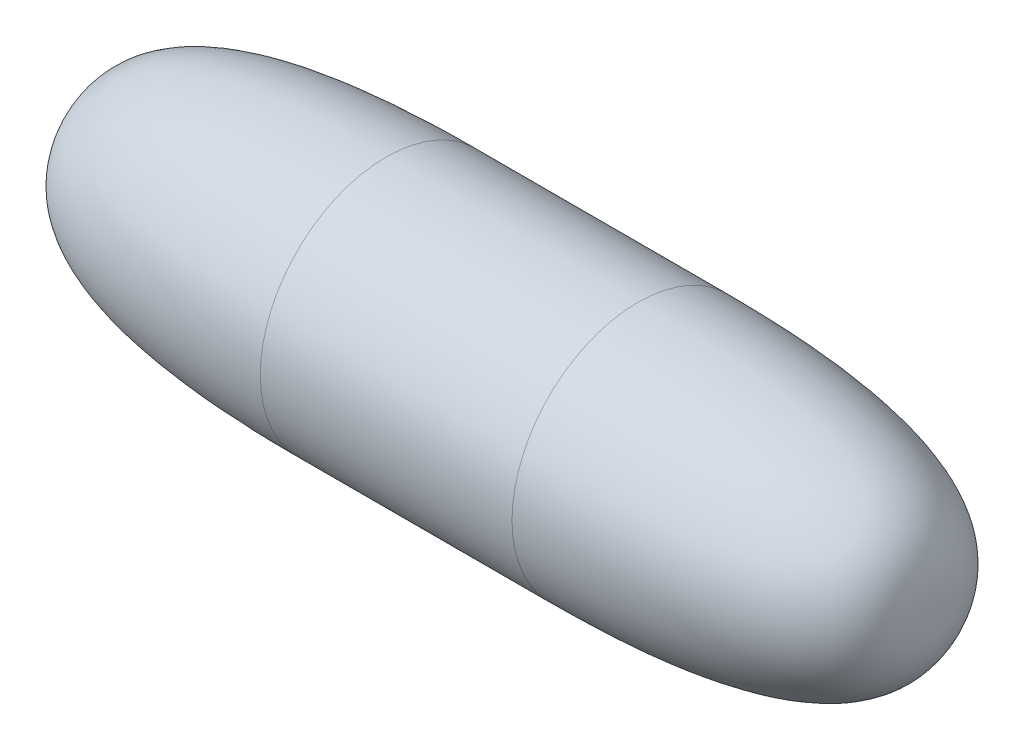
ISO-10303-21;
HEADER;
FILE_DESCRIPTION(('STEP AP214'),'2;1');
FILE_NAME('part.step','',(''),(''),'','','');
FILE_SCHEMA(('AUTOMOTIVE_DESIGN { 1 0 10303 214 1 1 1 1 }'));
ENDSEC;
DATA;
#1=APPLICATION_CONTEXT('core data for automotive mechanical design processes');
#2=APPLICATION_PROTOCOL_DEFINITION('international standard','automotive_design',2000,#1);
#3=PRODUCT_CONTEXT('',#1,'mechanical');
#4=PRODUCT('Part','Part','',(#3));
#5=PRODUCT_RELATED_PRODUCT_CATEGORY('part','',(#4));
#6=PRODUCT_DEFINITION_FORMATION('','',#4);
#7=PRODUCT_DEFINITION_CONTEXT('part definition',#1,'design');
#8=PRODUCT_DEFINITION('design','',#6,#7);
#9=PRODUCT_DEFINITION_SHAPE('','',#8);
#10=(LENGTH_UNIT() NAMED_UNIT(*) SI_UNIT(.MILLI.,.METRE.));
#11=(NAMED_UNIT(*) PLANE_ANGLE_UNIT() SI_UNIT($,.RADIAN.));
#12=(NAMED_UNIT(*) SI_UNIT($,.STERADIAN.) SOLID_ANGLE_UNIT());
#13=UNCERTAINTY_MEASURE_WITH_UNIT(LENGTH_MEASURE(1.E-05),#10,'distance_accuracy_value','');
#14=(GEOMETRIC_REPRESENTATION_CONTEXT(3) GLOBAL_UNCERTAINTY_ASSIGNED_CONTEXT((#13)) GLOBAL_UNIT_ASSIGNED_CONTEXT((#10,
#11,#12)) REPRESENTATION_CONTEXT('',''));
#15=CARTESIAN_POINT('',(0.,0.,0.));
#16=DIRECTION('',(0.,0.,1.));
#17=DIRECTION('',(1.,0.,0.));
#18=AXIS2_PLACEMENT_3D('',#15,#16,#17);
#19=CARTESIAN_POINT('',(63.5,0.,0.));
#20=CARTESIAN_POINT('',(63.5,6.92198843971197,0.));
#21=CARTESIAN_POINT('',(63.9087793878056,19.05,0.));
#22=CARTESIAN_POINT('',(19.05,19.05,0.));
#23=B_SPLINE_CURVE_WITH_KNOTS('',3,(#19,#20,#21,#22),.UNSPECIFIED.,.F.,.F.,(4,4),(0.,1.),.UNSPECIFIED.);
#24=CARTESIAN_POINT('',(0.,0.,0.));
#25=DIRECTION('',(-1.,0.,0.));
#26=AXIS1_PLACEMENT('',#24,#25);
#27=SURFACE_OF_REVOLUTION('',#23,#26);
#28=CARTESIAN_POINT('',(19.05,0.,0.));
#29=DIRECTION('',(-1.,0.,0.));
#30=DIRECTION('',(0.,0.,1.));
#31=AXIS2_PLACEMENT_3D('',#28,#29,#30);
#32=CIRCLE('',#31,19.05);
#33=CARTESIAN_POINT('',(19.05,0.,19.05));
#34=VERTEX_POINT('',#33);
#35=EDGE_CURVE('E11',#34,#34,#32,.T.);
#36=ORIENTED_EDGE('',*,*,#35,.F.);
#37=EDGE_LOOP('',(#36));
#38=FACE_BOUND('',#37,.T.);
#39=CARTESIAN_POINT('',(63.5,0.,0.));
#40=VERTEX_POINT('',#39);
#41=VERTEX_LOOP('',#40);
#42=FACE_BOUND('',#41,.T.);
#43=ADVANCED_FACE('F37',(#38,#42),#27,.T.);
#44=CARTESIAN_POINT('',(0.,0.,0.));
#45=DIRECTION('',(-1.,0.,0.));
#46=DIRECTION('',(0.,0.,1.));
#47=AXIS2_PLACEMENT_3D('',#44,#45,#46);
#48=CYLINDRICAL_SURFACE('',#47,19.05);
#49=ORIENTED_EDGE('',*,*,#35,.T.);
#50=EDGE_LOOP('',(#49));
#51=FACE_BOUND('',#50,.T.);
#52=CARTESIAN_POINT('',(-19.05,0.,0.));
#53=DIRECTION('',(-1.,0.,0.));
#54=DIRECTION('',(0.,0.,1.));
#55=AXIS2_PLACEMENT_3D('',#52,#53,#54);
#56=CIRCLE('',#55,19.05);
#57=CARTESIAN_POINT('',(-19.05,0.,19.05));
#58=VERTEX_POINT('',#57);
#59=EDGE_CURVE('E44',#58,#58,#56,.T.);
#60=ORIENTED_EDGE('',*,*,#59,.F.);
#61=EDGE_LOOP('',(#60));
#62=FACE_BOUND('',#61,.T.);
#63=ADVANCED_FACE('F52',(#51,#62),#48,.T.);
#64=CARTESIAN_POINT('',(-63.5,0.,0.));
#65=CARTESIAN_POINT('',(-63.5,6.92198843971197,0.));
#66=CARTESIAN_POINT('',(-63.9087793878056,19.05,0.));
#67=CARTESIAN_POINT('',(-19.05,19.05,0.));
#68=B_SPLINE_CURVE_WITH_KNOTS('',3,(#64,#65,#66,#67),.UNSPECIFIED.,.F.,.F.,(4,4),(0.,1.),.UNSPECIFIED.);
#69=CARTESIAN_POINT('',(0.,0.,0.));
#70=DIRECTION('',(1.,0.,0.));
#71=AXIS1_PLACEMENT('',#69,#70);
#72=SURFACE_OF_REVOLUTION('',#68,#71);
#73=ORIENTED_EDGE('',*,*,#59,.T.);
#74=EDGE_LOOP('',(#73));
#75=FACE_BOUND('',#74,.T.);
#76=CARTESIAN_POINT('',(-63.5,0.,0.));
#77=VERTEX_POINT('',#76);
#78=VERTEX_LOOP('',#77);
#79=FACE_BOUND('',#78,.T.);
#80=ADVANCED_FACE('F50',(#75,#79),#72,.T.);
#81=CLOSED_SHELL('',(#43,#63,#80));
#82=MANIFOLD_SOLID_BREP('B2',#81);
#83=ADVANCED_BREP_SHAPE_REPRESENTATION('',(#18,#82),#14);
#84=SHAPE_DEFINITION_REPRESENTATION(#9,#83);
ENDSEC;
END-ISO-10303-21;
